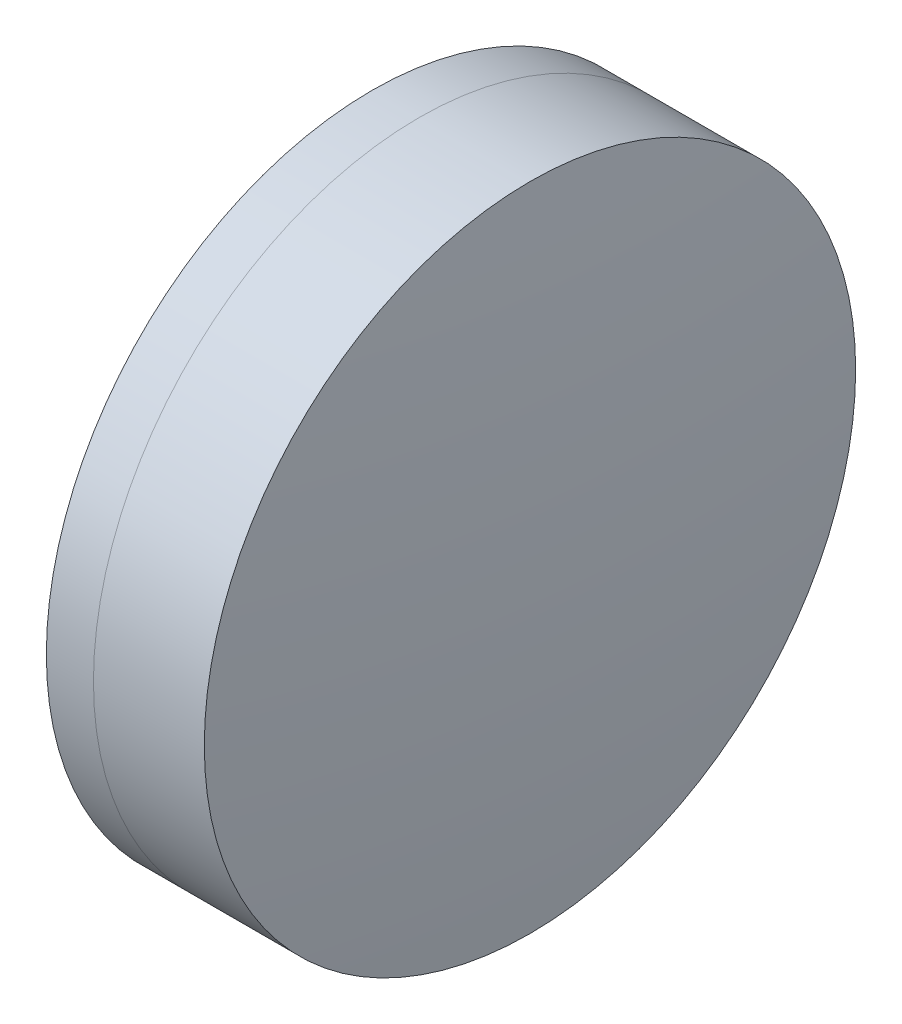
ISO-10303-21;
HEADER;
FILE_DESCRIPTION(('STEP AP214'),'2;1');
FILE_NAME('part.step','',(''),(''),'','','');
FILE_SCHEMA(('AUTOMOTIVE_DESIGN { 1 0 10303 214 1 1 1 1 }'));
ENDSEC;
DATA;
#1=APPLICATION_CONTEXT('core data for automotive mechanical design processes');
#2=APPLICATION_PROTOCOL_DEFINITION('international standard','automotive_design',2000,#1);
#3=PRODUCT_CONTEXT('',#1,'mechanical');
#4=PRODUCT('Part','Part','',(#3));
#5=PRODUCT_RELATED_PRODUCT_CATEGORY('part','',(#4));
#6=PRODUCT_DEFINITION_FORMATION('','',#4);
#7=PRODUCT_DEFINITION_CONTEXT('part definition',#1,'design');
#8=PRODUCT_DEFINITION('design','',#6,#7);
#9=PRODUCT_DEFINITION_SHAPE('','',#8);
#10=(LENGTH_UNIT() NAMED_UNIT(*) SI_UNIT(.MILLI.,.METRE.));
#11=(NAMED_UNIT(*) PLANE_ANGLE_UNIT() SI_UNIT($,.RADIAN.));
#12=(NAMED_UNIT(*) SI_UNIT($,.STERADIAN.) SOLID_ANGLE_UNIT());
#13=UNCERTAINTY_MEASURE_WITH_UNIT(LENGTH_MEASURE(1.E-05),#10,'distance_accuracy_value','');
#14=(GEOMETRIC_REPRESENTATION_CONTEXT(3) GLOBAL_UNCERTAINTY_ASSIGNED_CONTEXT((#13)) GLOBAL_UNIT_ASSIGNED_CONTEXT((#10,
#11,#12)) REPRESENTATION_CONTEXT('',''));
#15=CARTESIAN_POINT('',(0.,0.,0.));
#16=DIRECTION('',(0.,0.,1.));
#17=DIRECTION('',(1.,0.,0.));
#18=AXIS2_PLACEMENT_3D('',#15,#16,#17);
#19=CARTESIAN_POINT('',(264.478986554565,0.,0.));
#20=DIRECTION('',(-1.,0.,0.));
#21=DIRECTION('',(0.,0.,1.));
#22=AXIS2_PLACEMENT_3D('',#19,#20,#21);
#23=SPHERICAL_SURFACE('',#22,27.0500000000001);
#24=CARTESIAN_POINT('',(288.362296626664,0.,0.));
#25=DIRECTION('',(-1.,0.,0.));
#26=DIRECTION('',(0.,0.,1.));
#27=AXIS2_PLACEMENT_3D('',#24,#25,#26);
#28=CIRCLE('',#27,12.7);
#29=CARTESIAN_POINT('',(288.362296626664,0.,12.7));
#30=VERTEX_POINT('',#29);
#31=EDGE_CURVE('E11',#30,#30,#28,.T.);
#32=ORIENTED_EDGE('',*,*,#31,.T.);
#33=EDGE_LOOP('',(#32));
#34=FACE_BOUND('',#33,.T.);
#35=ADVANCED_FACE('F43',(#34),#23,.F.);
#36=CARTESIAN_POINT('',(-0.551919992657797,0.,0.));
#37=DIRECTION('',(-1.,0.,0.));
#38=DIRECTION('',(0.,0.,1.));
#39=AXIS2_PLACEMENT_3D('',#36,#37,#38);
#40=CYLINDRICAL_SURFACE('',#39,12.7);
#41=CARTESIAN_POINT('',(292.685258906136,0.,0.));
#42=DIRECTION('',(-1.,0.,0.));
#43=DIRECTION('',(0.,0.,1.));
#44=AXIS2_PLACEMENT_3D('',#41,#42,#43);
#45=CIRCLE('',#44,12.7);
#46=CARTESIAN_POINT('',(292.685258906136,0.,12.7));
#47=VERTEX_POINT('',#46);
#48=EDGE_CURVE('E49',#47,#47,#45,.T.);
#49=ORIENTED_EDGE('',*,*,#48,.T.);
#50=EDGE_LOOP('',(#49));
#51=FACE_BOUND('',#50,.T.);
#52=ORIENTED_EDGE('',*,*,#31,.F.);
#53=EDGE_LOOP('',(#52));
#54=FACE_BOUND('',#53,.T.);
#55=ADVANCED_FACE('F55',(#51,#54),#40,.T.);
#56=CARTESIAN_POINT('',(167.728986554565,0.,0.));
#57=DIRECTION('',(-1.,0.,0.));
#58=DIRECTION('',(0.,0.,1.));
#59=AXIS2_PLACEMENT_3D('',#56,#57,#58);
#60=SPHERICAL_SURFACE('',#59,125.6);
#61=ORIENTED_EDGE('',*,*,#48,.F.);
#62=EDGE_LOOP('',(#61));
#63=FACE_BOUND('',#62,.T.);
#64=ADVANCED_FACE('F58',(#63),#60,.T.);
#65=CLOSED_SHELL('',(#35,#55,#64));
#66=MANIFOLD_SOLID_BREP('B2',#65);
#67=CARTESIAN_POINT('',(317.578986554565,0.,0.));
#68=DIRECTION('',(-1.,0.,0.));
#69=DIRECTION('',(0.,0.,-1.));
#70=AXIS2_PLACEMENT_3D('',#67,#68,#69);
#71=SPHERICAL_SURFACE('',#70,33.55);
#72=CARTESIAN_POINT('',(286.52560509618,0.,0.));
#73=DIRECTION('',(-1.,0.,0.));
#74=DIRECTION('',(0.,0.,1.));
#75=AXIS2_PLACEMENT_3D('',#72,#73,#74);
#76=CIRCLE('',#75,12.7);
#77=CARTESIAN_POINT('',(286.52560509618,0.,12.7));
#78=VERTEX_POINT('',#77);
#79=EDGE_CURVE('E42',#78,#78,#76,.T.);
#80=ORIENTED_EDGE('',*,*,#79,.T.);
#81=EDGE_LOOP('',(#80));
#82=FACE_BOUND('',#81,.T.);
#83=ADVANCED_FACE('F84',(#82),#71,.T.);
#84=CARTESIAN_POINT('',(124.523309526045,0.,0.));
#85=DIRECTION('',(-1.,0.,0.));
#86=DIRECTION('',(0.,0.,1.));
#87=AXIS2_PLACEMENT_3D('',#84,#85,#86);
#88=CYLINDRICAL_SURFACE('',#87,12.7);
#89=CARTESIAN_POINT('',(288.362296626664,0.,0.));
#90=DIRECTION('',(-1.,0.,0.));
#91=DIRECTION('',(0.,0.,1.));
#92=AXIS2_PLACEMENT_3D('',#89,#90,#91);
#93=CIRCLE('',#92,12.7);
#94=CARTESIAN_POINT('',(288.362296626664,0.,12.7));
#95=VERTEX_POINT('',#94);
#96=EDGE_CURVE('E90',#95,#95,#93,.T.);
#97=ORIENTED_EDGE('',*,*,#96,.T.);
#98=EDGE_LOOP('',(#97));
#99=FACE_BOUND('',#98,.T.);
#100=ORIENTED_EDGE('',*,*,#79,.F.);
#101=EDGE_LOOP('',(#100));
#102=FACE_BOUND('',#101,.T.);
#103=ADVANCED_FACE('F96',(#99,#102),#88,.T.);
#104=CARTESIAN_POINT('',(264.478986554565,0.,0.));
#105=DIRECTION('',(-1.,0.,0.));
#106=DIRECTION('',(0.,0.,1.));
#107=AXIS2_PLACEMENT_3D('',#104,#105,#106);
#108=SPHERICAL_SURFACE('',#107,27.0500000000001);
#109=ORIENTED_EDGE('',*,*,#96,.F.);
#110=EDGE_LOOP('',(#109));
#111=FACE_BOUND('',#110,.T.);
#112=ADVANCED_FACE('F99',(#111),#108,.T.);
#113=CLOSED_SHELL('',(#83,#103,#112));
#114=MANIFOLD_SOLID_BREP('B6',#113);
#115=ADVANCED_BREP_SHAPE_REPRESENTATION('',(#18,#66,#114),#14);
#116=SHAPE_DEFINITION_REPRESENTATION(#9,#115);
ENDSEC;
END-ISO-10303-21;
